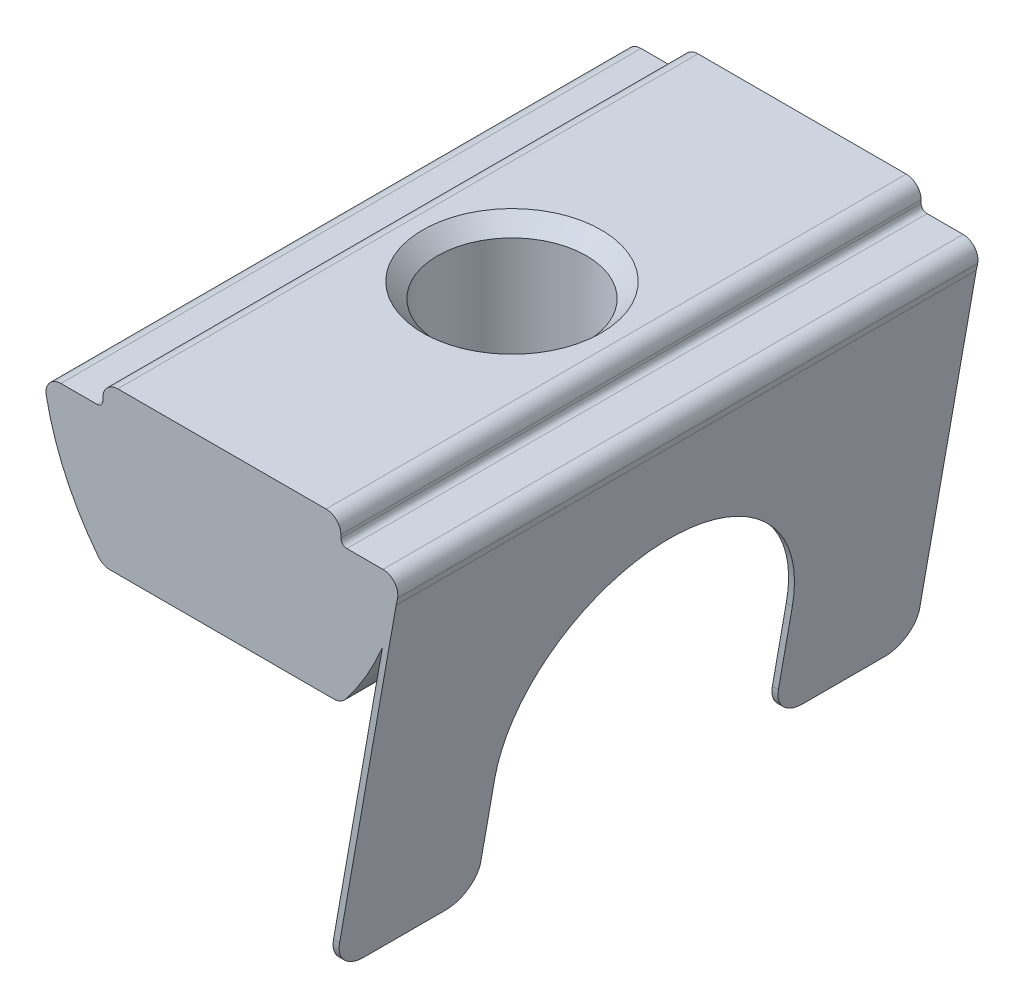
ISO-10303-21;
HEADER;
FILE_DESCRIPTION(('STEP AP214'),'2;1');
FILE_NAME('part.step','',(''),(''),'','','');
FILE_SCHEMA(('AUTOMOTIVE_DESIGN { 1 0 10303 214 1 1 1 1 }'));
ENDSEC;
DATA;
#1=APPLICATION_CONTEXT('core data for automotive mechanical design processes');
#2=APPLICATION_PROTOCOL_DEFINITION('international standard','automotive_design',2000,#1);
#3=PRODUCT_CONTEXT('',#1,'mechanical');
#4=PRODUCT('Part','Part','',(#3));
#5=PRODUCT_RELATED_PRODUCT_CATEGORY('part','',(#4));
#6=PRODUCT_DEFINITION_FORMATION('','',#4);
#7=PRODUCT_DEFINITION_CONTEXT('part definition',#1,'design');
#8=PRODUCT_DEFINITION('design','',#6,#7);
#9=PRODUCT_DEFINITION_SHAPE('','',#8);
#10=(LENGTH_UNIT() NAMED_UNIT(*) SI_UNIT(.MILLI.,.METRE.));
#11=(NAMED_UNIT(*) PLANE_ANGLE_UNIT() SI_UNIT($,.RADIAN.));
#12=(NAMED_UNIT(*) SI_UNIT($,.STERADIAN.) SOLID_ANGLE_UNIT());
#13=UNCERTAINTY_MEASURE_WITH_UNIT(LENGTH_MEASURE(1.E-05),#10,'distance_accuracy_value','');
#14=(GEOMETRIC_REPRESENTATION_CONTEXT(3) GLOBAL_UNCERTAINTY_ASSIGNED_CONTEXT((#13)) GLOBAL_UNIT_ASSIGNED_CONTEXT((#10,
#11,#12)) REPRESENTATION_CONTEXT('',''));
#15=CARTESIAN_POINT('',(0.,0.,0.));
#16=DIRECTION('',(0.,0.,1.));
#17=DIRECTION('',(1.,0.,0.));
#18=AXIS2_PLACEMENT_3D('',#15,#16,#17);
#19=CARTESIAN_POINT('',(2.29567270734946,-3.97311842727961,-23.8344004734254));
#20=DIRECTION('',(0.,-1.,0.));
#21=DIRECTION('',(0.,0.,-1.));
#22=AXIS2_PLACEMENT_3D('',#19,#20,#21);
#23=PLANE('',#22);
#24=DIRECTION('',(0.,0.,1.));
#25=VECTOR('',#24,1.);
#26=CARTESIAN_POINT('',(2.29567270734946,-3.97311842727961,-23.8344004734254));
#27=LINE('',#26,#25);
#28=CARTESIAN_POINT('',(2.29567270734946,-3.97311842727961,4.75242303511413));
#29=VERTEX_POINT('',#28);
#30=CARTESIAN_POINT('',(2.29567270734946,-3.97311842727961,7.50242303511413));
#31=VERTEX_POINT('',#30);
#32=EDGE_CURVE('E247',#29,#31,#27,.T.);
#33=ORIENTED_EDGE('',*,*,#32,.T.);
#34=DIRECTION('',(1.,0.,0.));
#35=VECTOR('',#34,1.);
#36=CARTESIAN_POINT('',(2.09258738497231,-3.97311842727961,7.50242303511413));
#37=LINE('',#36,#35);
#38=CARTESIAN_POINT('',(2.09258738497231,-3.97311842727961,7.50242303511413));
#39=VERTEX_POINT('',#38);
#40=EDGE_CURVE('E402',#31,#39,#37,.F.);
#41=ORIENTED_EDGE('',*,*,#40,.T.);
#42=DIRECTION('',(0.,0.,1.));
#43=VECTOR('',#42,1.);
#44=CARTESIAN_POINT('',(2.09258738497231,-3.97311842727961,-23.8344004734254));
#45=LINE('',#44,#43);
#46=CARTESIAN_POINT('',(2.09258738497231,-3.97311842727961,4.75242303511413));
#47=VERTEX_POINT('',#46);
#48=EDGE_CURVE('E242',#47,#39,#45,.T.);
#49=ORIENTED_EDGE('',*,*,#48,.F.);
#50=DIRECTION('',(-1.,0.,0.));
#51=VECTOR('',#50,1.);
#52=CARTESIAN_POINT('',(2.29567270734946,-3.97311842727961,4.75242303511413));
#53=LINE('',#52,#51);
#54=EDGE_CURVE('E400',#47,#29,#53,.F.);
#55=ORIENTED_EDGE('',*,*,#54,.T.);
#56=EDGE_LOOP('',(#33,#41,#49,#55));
#57=FACE_BOUND('',#56,.T.);
#58=ADVANCED_FACE('F16',(#57),#23,.T.);
#59=CARTESIAN_POINT('',(-4.408320755903,9.77880782753279,8.50242303511413));
#60=DIRECTION('',(0.,0.,-1.));
#61=DIRECTION('',(-1.,0.,0.));
#62=AXIS2_PLACEMENT_3D('',#59,#60,#61);
#63=CYLINDRICAL_SURFACE('',#62,9.);
#64=CARTESIAN_POINT('',(-4.408320755903,9.77880782753279,-10.9975769648859));
#65=DIRECTION('',(0.,0.,1.));
#66=DIRECTION('',(-1.,0.,0.));
#67=AXIS2_PLACEMENT_3D('',#64,#65,#66);
#68=CIRCLE('',#67,9.);
#69=CARTESIAN_POINT('',(4.3721115458505,7.80295140705995,-10.9975769648859));
#70=VERTEX_POINT('',#69);
#71=CARTESIAN_POINT('',(4.4212396874186,8.03557451620278,-10.9975769648859));
#72=VERTEX_POINT('',#71);
#73=EDGE_CURVE('E292',#70,#72,#68,.T.);
#74=ORIENTED_EDGE('',*,*,#73,.T.);
#75=DIRECTION('',(0.,0.,-1.));
#76=VECTOR('',#75,1.);
#77=CARTESIAN_POINT('',(4.4212396874186,8.03557451620278,8.50242303511413));
#78=LINE('',#77,#76);
#79=CARTESIAN_POINT('',(4.4212396874186,8.03557451620278,8.50242303511413));
#80=VERTEX_POINT('',#79);
#81=EDGE_CURVE('E343',#72,#80,#78,.F.);
#82=ORIENTED_EDGE('',*,*,#81,.T.);
#83=CARTESIAN_POINT('',(-4.408320755903,9.77880782753279,8.50242303511413));
#84=DIRECTION('',(0.,0.,1.));
#85=DIRECTION('',(-1.,0.,0.));
#86=AXIS2_PLACEMENT_3D('',#83,#84,#85);
#87=CIRCLE('',#86,9.);
#88=CARTESIAN_POINT('',(4.3721115458505,7.80295140705995,8.50242303511413));
#89=VERTEX_POINT('',#88);
#90=EDGE_CURVE('E270',#89,#80,#87,.T.);
#91=ORIENTED_EDGE('',*,*,#90,.F.);
#92=DIRECTION('',(0.,0.,-1.));
#93=VECTOR('',#92,1.);
#94=CARTESIAN_POINT('',(4.3721115458505,7.80295140705995,8.50242303511413));
#95=LINE('',#94,#93);
#96=EDGE_CURVE('E254',#89,#70,#95,.T.);
#97=ORIENTED_EDGE('',*,*,#96,.T.);
#98=EDGE_LOOP('',(#74,#82,#91,#97));
#99=FACE_BOUND('',#98,.T.);
#100=ADVANCED_FACE('F443',(#99),#63,.T.);
#101=CARTESIAN_POINT('',(-5.48163061851392,8.63242081127667,8.50242303511413));
#102=DIRECTION('',(1.,0.,0.));
#103=DIRECTION('',(0.,0.,-1.));
#104=AXIS2_PLACEMENT_3D('',#101,#102,#103);
#105=PLANE('',#104);
#106=DIRECTION('',(0.,-1.,0.));
#107=VECTOR('',#106,1.);
#108=CARTESIAN_POINT('',(-5.48163061851392,8.63242081127667,-10.9975769648859));
#109=LINE('',#108,#107);
#110=CARTESIAN_POINT('',(-5.48163061851392,8.93242081127667,-10.9975769648859));
#111=VERTEX_POINT('',#110);
#112=CARTESIAN_POINT('',(-5.48163061851392,8.83242081127667,-10.9975769648859));
#113=VERTEX_POINT('',#112);
#114=EDGE_CURVE('E257',#111,#113,#109,.T.);
#115=ORIENTED_EDGE('',*,*,#114,.T.);
#116=DIRECTION('',(0.,0.,-1.));
#117=VECTOR('',#116,1.);
#118=CARTESIAN_POINT('',(-5.48163061851392,8.83242081127667,8.50242303511413));
#119=LINE('',#118,#117);
#120=CARTESIAN_POINT('',(-5.48163061851392,8.83242081127667,8.50242303511413));
#121=VERTEX_POINT('',#120);
#122=EDGE_CURVE('E379',#113,#121,#119,.F.);
#123=ORIENTED_EDGE('',*,*,#122,.T.);
#124=DIRECTION('',(0.,-1.,0.));
#125=VECTOR('',#124,1.);
#126=CARTESIAN_POINT('',(-5.48163061851392,8.63242081127667,8.50242303511413));
#127=LINE('',#126,#125);
#128=CARTESIAN_POINT('',(-5.48163061851392,8.93242081127667,8.50242303511413));
#129=VERTEX_POINT('',#128);
#130=EDGE_CURVE('E258',#129,#121,#127,.T.);
#131=ORIENTED_EDGE('',*,*,#130,.F.);
#132=DIRECTION('',(0.,0.,-1.));
#133=VECTOR('',#132,1.);
#134=CARTESIAN_POINT('',(-5.48163061851392,8.93242081127667,8.50242303511413));
#135=LINE('',#134,#133);
#136=EDGE_CURVE('E356',#129,#111,#135,.T.);
#137=ORIENTED_EDGE('',*,*,#136,.T.);
#138=EDGE_LOOP('',(#115,#123,#131,#137));
#139=FACE_BOUND('',#138,.T.);
#140=ADVANCED_FACE('F449',(#139),#105,.F.);
#141=CARTESIAN_POINT('',(-7.48163061851392,8.63242081127667,8.50242303511413));
#142=DIRECTION('',(0.,-1.,0.));
#143=DIRECTION('',(0.,0.,-1.));
#144=AXIS2_PLACEMENT_3D('',#141,#142,#143);
#145=PLANE('',#144);
#146=DIRECTION('',(-1.,0.,0.));
#147=VECTOR('',#146,1.);
#148=CARTESIAN_POINT('',(-7.48163061851392,8.63242081127667,8.50242303511413));
#149=LINE('',#148,#147);
#150=CARTESIAN_POINT('',(-5.68163061851392,8.63242081127667,8.50242303511413));
#151=VERTEX_POINT('',#150);
#152=CARTESIAN_POINT('',(-6.89396978870635,8.63242081127667,8.50242303511413));
#153=VERTEX_POINT('',#152);
#154=EDGE_CURVE('E261',#151,#153,#149,.T.);
#155=ORIENTED_EDGE('',*,*,#154,.F.);
#156=DIRECTION('',(0.,0.,-1.));
#157=VECTOR('',#156,1.);
#158=CARTESIAN_POINT('',(-5.68163061851392,8.63242081127667,-10.9975769648859));
#159=LINE('',#158,#157);
#160=CARTESIAN_POINT('',(-5.68163061851392,8.63242081127667,-10.9975769648859));
#161=VERTEX_POINT('',#160);
#162=EDGE_CURVE('E376',#151,#161,#159,.T.);
#163=ORIENTED_EDGE('',*,*,#162,.T.);
#164=DIRECTION('',(-1.,0.,0.));
#165=VECTOR('',#164,1.);
#166=CARTESIAN_POINT('',(-7.48163061851392,8.63242081127667,-10.9975769648859));
#167=LINE('',#166,#165);
#168=CARTESIAN_POINT('',(-6.89396978870635,8.63242081127667,-10.9975769648859));
#169=VERTEX_POINT('',#168);
#170=EDGE_CURVE('E284',#161,#169,#167,.T.);
#171=ORIENTED_EDGE('',*,*,#170,.T.);
#172=DIRECTION('',(0.,0.,-1.));
#173=VECTOR('',#172,1.);
#174=CARTESIAN_POINT('',(-6.89396978870635,8.63242081127667,8.50242303511413));
#175=LINE('',#174,#173);
#176=EDGE_CURVE('E345',#169,#153,#175,.F.);
#177=ORIENTED_EDGE('',*,*,#176,.T.);
#178=EDGE_LOOP('',(#155,#163,#171,#177));
#179=FACE_BOUND('',#178,.T.);
#180=ADVANCED_FACE('F499',(#179),#145,.F.);
#181=CARTESIAN_POINT('',(1.44505951887515,9.77880782753279,8.50242303511413));
#182=DIRECTION('',(0.,0.,-1.));
#183=DIRECTION('',(-1.,0.,0.));
#184=AXIS2_PLACEMENT_3D('',#181,#182,#183);
#185=CYLINDRICAL_SURFACE('',#184,9.);
#186=CARTESIAN_POINT('',(1.44505951887515,9.77880782753279,-10.9975769648859));
#187=DIRECTION('',(0.,0.,1.));
#188=DIRECTION('',(1.,0.,0.));
#189=AXIS2_PLACEMENT_3D('',#186,#187,#188);
#190=CIRCLE('',#189,9.);
#191=CARTESIAN_POINT('',(-7.38450092444644,8.03557451620278,-10.9975769648859));
#192=VERTEX_POINT('',#191);
#193=CARTESIAN_POINT('',(-5.6360418805377,4.22380981032043,-10.9975769648859));
#194=VERTEX_POINT('',#193);
#195=EDGE_CURVE('E286',#192,#194,#190,.T.);
#196=ORIENTED_EDGE('',*,*,#195,.T.);
#197=DIRECTION('',(0.,0.,-1.));
#198=VECTOR('',#197,1.);
#199=CARTESIAN_POINT('',(-5.6360418805377,4.22380981032043,8.50242303511413));
#200=LINE('',#199,#198);
#201=CARTESIAN_POINT('',(-5.6360418805377,4.22380981032043,8.50242303511413));
#202=VERTEX_POINT('',#201);
#203=EDGE_CURVE('E338',#194,#202,#200,.F.);
#204=ORIENTED_EDGE('',*,*,#203,.T.);
#205=CARTESIAN_POINT('',(1.44505951887515,9.77880782753279,8.50242303511413));
#206=DIRECTION('',(0.,0.,1.));
#207=DIRECTION('',(1.,0.,0.));
#208=AXIS2_PLACEMENT_3D('',#205,#206,#207);
#209=CIRCLE('',#208,9.);
#210=CARTESIAN_POINT('',(-7.38450092444644,8.03557451620278,8.50242303511413));
#211=VERTEX_POINT('',#210);
#212=EDGE_CURVE('E264',#211,#202,#209,.T.);
#213=ORIENTED_EDGE('',*,*,#212,.F.);
#214=DIRECTION('',(0.,0.,-1.));
#215=VECTOR('',#214,1.);
#216=CARTESIAN_POINT('',(-7.38450092444644,8.03557451620278,8.50242303511413));
#217=LINE('',#216,#215);
#218=EDGE_CURVE('E335',#211,#192,#217,.T.);
#219=ORIENTED_EDGE('',*,*,#218,.T.);
#220=EDGE_LOOP('',(#196,#204,#213,#219));
#221=FACE_BOUND('',#220,.T.);
#222=ADVANCED_FACE('F495',(#221),#185,.T.);
#223=CARTESIAN_POINT('',(2.51836938148608,4.03242081127667,8.50242303511413));
#224=DIRECTION('',(0.,1.,0.));
#225=DIRECTION('',(0.,0.,1.));
#226=AXIS2_PLACEMENT_3D('',#223,#224,#225);
#227=PLANE('',#226);
#228=CARTESIAN_POINT('',(-1.48163061851392,4.03242081127667,-1.24757696488587));
#229=DIRECTION('',(0.,1.,0.));
#230=DIRECTION('',(0.,0.,1.));
#231=AXIS2_PLACEMENT_3D('',#228,#229,#230);
#232=CIRCLE('',#231,3.);
#233=CARTESIAN_POINT('',(-1.48163061851392,4.03242081127667,1.75242303511413));
#234=VERTEX_POINT('',#233);
#235=EDGE_CURVE('E359',#234,#234,#232,.T.);
#236=ORIENTED_EDGE('',*,*,#235,.T.);
#237=EDGE_LOOP('',(#236));
#238=FACE_BOUND('',#237,.T.);
#239=DIRECTION('',(1.,0.,0.));
#240=VECTOR('',#239,1.);
#241=CARTESIAN_POINT('',(2.51836938148608,4.03242081127667,-10.9975769648859));
#242=LINE('',#241,#240);
#243=CARTESIAN_POINT('',(-5.2426473583481,4.03242081127667,-10.9975769648859));
#244=VERTEX_POINT('',#243);
#245=CARTESIAN_POINT('',(2.27938612132026,4.03242081127667,-10.9975769648859));
#246=VERTEX_POINT('',#245);
#247=EDGE_CURVE('E289',#244,#246,#242,.T.);
#248=ORIENTED_EDGE('',*,*,#247,.T.);
#249=DIRECTION('',(0.,0.,-1.));
#250=VECTOR('',#249,1.);
#251=CARTESIAN_POINT('',(2.27938612132026,4.03242081127667,8.50242303511413));
#252=LINE('',#251,#250);
#253=CARTESIAN_POINT('',(2.27938612132026,4.03242081127667,8.50242303511413));
#254=VERTEX_POINT('',#253);
#255=EDGE_CURVE('E321',#246,#254,#252,.F.);
#256=ORIENTED_EDGE('',*,*,#255,.T.);
#257=DIRECTION('',(1.,0.,0.));
#258=VECTOR('',#257,1.);
#259=CARTESIAN_POINT('',(2.51836938148608,4.03242081127667,8.50242303511413));
#260=LINE('',#259,#258);
#261=CARTESIAN_POINT('',(-5.2426473583481,4.03242081127667,8.50242303511413));
#262=VERTEX_POINT('',#261);
#263=EDGE_CURVE('E267',#262,#254,#260,.T.);
#264=ORIENTED_EDGE('',*,*,#263,.F.);
#265=DIRECTION('',(0.,0.,-1.));
#266=VECTOR('',#265,1.);
#267=CARTESIAN_POINT('',(-5.2426473583481,4.03242081127667,8.50242303511413));
#268=LINE('',#267,#266);
#269=EDGE_CURVE('E318',#262,#244,#268,.T.);
#270=ORIENTED_EDGE('',*,*,#269,.T.);
#271=EDGE_LOOP('',(#248,#256,#264,#270));
#272=FACE_BOUND('',#271,.T.);
#273=ADVANCED_FACE('F491',(#238,#272),#227,.F.);
#274=CARTESIAN_POINT('',(2.67278064350986,4.22380981032043,8.50242303511413));
#275=VERTEX_POINT('',#274);
#276=CARTESIAN_POINT('',(3.91275534065847,6.34956700845439,8.50242303511413));
#277=VERTEX_POINT('',#276);
#278=EDGE_CURVE('E271',#275,#277,#87,.T.);
#279=ORIENTED_EDGE('',*,*,#278,.F.);
#280=DIRECTION('',(0.,0.,-1.));
#281=VECTOR('',#280,1.);
#282=CARTESIAN_POINT('',(2.67278064350986,4.22380981032043,8.50242303511413));
#283=LINE('',#282,#281);
#284=CARTESIAN_POINT('',(2.67278064350986,4.22380981032043,-10.9975769648859));
#285=VERTEX_POINT('',#284);
#286=EDGE_CURVE('E281',#275,#285,#283,.T.);
#287=ORIENTED_EDGE('',*,*,#286,.T.);
#288=CARTESIAN_POINT('',(3.91275534065846,6.34956700845438,-10.9975769648859));
#289=VERTEX_POINT('',#288);
#290=EDGE_CURVE('E293',#285,#289,#68,.T.);
#291=ORIENTED_EDGE('',*,*,#290,.T.);
#292=DIRECTION('',(0.,0.,1.));
#293=VECTOR('',#292,1.);
#294=CARTESIAN_POINT('',(3.91275534065846,6.34956700845438,-23.8344004734254));
#295=LINE('',#294,#293);
#296=EDGE_CURVE('E245',#289,#277,#295,.T.);
#297=ORIENTED_EDGE('',*,*,#296,.T.);
#298=EDGE_LOOP('',(#279,#287,#291,#297));
#299=FACE_BOUND('',#298,.T.);
#300=ADVANCED_FACE('F452',(#299),#63,.T.);
#301=CARTESIAN_POINT('',(2.51836938148608,8.63242081127667,8.50242303511413));
#302=DIRECTION('',(0.,-1.,0.));
#303=DIRECTION('',(0.,0.,-1.));
#304=AXIS2_PLACEMENT_3D('',#301,#302,#303);
#305=PLANE('',#304);
#306=DIRECTION('',(-1.,0.,0.));
#307=VECTOR('',#306,1.);
#308=CARTESIAN_POINT('',(2.51836938148608,8.63242081127667,-10.9975769648859));
#309=LINE('',#308,#307);
#310=CARTESIAN_POINT('',(3.93070855167851,8.63242081127667,-10.9975769648859));
#311=VERTEX_POINT('',#310);
#312=CARTESIAN_POINT('',(2.71836938148608,8.63242081127667,-10.9975769648859));
#313=VERTEX_POINT('',#312);
#314=EDGE_CURVE('E295',#311,#313,#309,.T.);
#315=ORIENTED_EDGE('',*,*,#314,.T.);
#316=DIRECTION('',(0.,0.,-1.));
#317=VECTOR('',#316,1.);
#318=CARTESIAN_POINT('',(2.71836938148608,8.63242081127667,8.50242303511413));
#319=LINE('',#318,#317);
#320=CARTESIAN_POINT('',(2.71836938148608,8.63242081127667,8.50242303511413));
#321=VERTEX_POINT('',#320);
#322=EDGE_CURVE('E374',#313,#321,#319,.F.);
#323=ORIENTED_EDGE('',*,*,#322,.T.);
#324=DIRECTION('',(-1.,0.,0.));
#325=VECTOR('',#324,1.);
#326=CARTESIAN_POINT('',(2.51836938148608,8.63242081127667,8.50242303511413));
#327=LINE('',#326,#325);
#328=CARTESIAN_POINT('',(3.93070855167851,8.63242081127667,8.50242303511413));
#329=VERTEX_POINT('',#328);
#330=EDGE_CURVE('E273',#329,#321,#327,.T.);
#331=ORIENTED_EDGE('',*,*,#330,.F.);
#332=DIRECTION('',(0.,0.,-1.));
#333=VECTOR('',#332,1.);
#334=CARTESIAN_POINT('',(3.93070855167851,8.63242081127667,8.50242303511413));
#335=LINE('',#334,#333);
#336=EDGE_CURVE('E340',#329,#311,#335,.T.);
#337=ORIENTED_EDGE('',*,*,#336,.T.);
#338=EDGE_LOOP('',(#315,#323,#331,#337));
#339=FACE_BOUND('',#338,.T.);
#340=ADVANCED_FACE('F485',(#339),#305,.F.);
#341=CARTESIAN_POINT('',(2.51836938148608,9.43242081127667,8.50242303511413));
#342=DIRECTION('',(-1.,0.,0.));
#343=DIRECTION('',(0.,0.,1.));
#344=AXIS2_PLACEMENT_3D('',#341,#342,#343);
#345=PLANE('',#344);
#346=DIRECTION('',(0.,1.,0.));
#347=VECTOR('',#346,1.);
#348=CARTESIAN_POINT('',(2.51836938148608,9.43242081127667,8.50242303511413));
#349=LINE('',#348,#347);
#350=CARTESIAN_POINT('',(2.51836938148608,8.83242081127667,8.50242303511413));
#351=VERTEX_POINT('',#350);
#352=CARTESIAN_POINT('',(2.51836938148608,8.93242081127667,8.50242303511413));
#353=VERTEX_POINT('',#352);
#354=EDGE_CURVE('E276',#351,#353,#349,.T.);
#355=ORIENTED_EDGE('',*,*,#354,.F.);
#356=DIRECTION('',(0.,0.,-1.));
#357=VECTOR('',#356,1.);
#358=CARTESIAN_POINT('',(2.51836938148608,8.83242081127667,-10.9975769648859));
#359=LINE('',#358,#357);
#360=CARTESIAN_POINT('',(2.51836938148608,8.83242081127667,-10.9975769648859));
#361=VERTEX_POINT('',#360);
#362=EDGE_CURVE('E371',#351,#361,#359,.T.);
#363=ORIENTED_EDGE('',*,*,#362,.T.);
#364=DIRECTION('',(0.,1.,0.));
#365=VECTOR('',#364,1.);
#366=CARTESIAN_POINT('',(2.51836938148608,9.43242081127667,-10.9975769648859));
#367=LINE('',#366,#365);
#368=CARTESIAN_POINT('',(2.51836938148608,8.93242081127667,-10.9975769648859));
#369=VERTEX_POINT('',#368);
#370=EDGE_CURVE('E298',#361,#369,#367,.T.);
#371=ORIENTED_EDGE('',*,*,#370,.T.);
#372=DIRECTION('',(0.,0.,-1.));
#373=VECTOR('',#372,1.);
#374=CARTESIAN_POINT('',(2.51836938148608,8.93242081127667,8.50242303511413));
#375=LINE('',#374,#373);
#376=EDGE_CURVE('E353',#369,#353,#375,.F.);
#377=ORIENTED_EDGE('',*,*,#376,.T.);
#378=EDGE_LOOP('',(#355,#363,#371,#377));
#379=FACE_BOUND('',#378,.T.);
#380=ADVANCED_FACE('F481',(#379),#345,.F.);
#381=CARTESIAN_POINT('',(-5.48163061851392,9.43242081127667,8.50242303511413));
#382=DIRECTION('',(0.,-1.,0.));
#383=DIRECTION('',(1.,0.,0.));
#384=AXIS2_PLACEMENT_3D('',#381,#382,#383);
#385=PLANE('',#384);
#386=CARTESIAN_POINT('',(-1.48163061851392,9.43242081127667,-1.24757696488587));
#387=DIRECTION('',(0.,-1.,0.));
#388=DIRECTION('',(1.,0.,0.));
#389=AXIS2_PLACEMENT_3D('',#386,#387,#388);
#390=CIRCLE('',#389,3.);
#391=CARTESIAN_POINT('',(1.51836938148608,9.43242081127667,-1.24757696488587));
#392=VERTEX_POINT('',#391);
#393=EDGE_CURVE('E368',#392,#392,#390,.T.);
#394=ORIENTED_EDGE('',*,*,#393,.T.);
#395=EDGE_LOOP('',(#394));
#396=FACE_BOUND('',#395,.T.);
#397=DIRECTION('',(-1.,0.,0.));
#398=VECTOR('',#397,1.);
#399=CARTESIAN_POINT('',(-5.48163061851392,9.43242081127667,8.50242303511413));
#400=LINE('',#399,#398);
#401=CARTESIAN_POINT('',(2.01836938148608,9.43242081127667,8.50242303511413));
#402=VERTEX_POINT('',#401);
#403=CARTESIAN_POINT('',(-4.98163061851392,9.43242081127667,8.50242303511413));
#404=VERTEX_POINT('',#403);
#405=EDGE_CURVE('E278',#402,#404,#400,.T.);
#406=ORIENTED_EDGE('',*,*,#405,.F.);
#407=DIRECTION('',(0.,0.,-1.));
#408=VECTOR('',#407,1.);
#409=CARTESIAN_POINT('',(2.01836938148608,9.43242081127667,8.50242303511413));
#410=LINE('',#409,#408);
#411=CARTESIAN_POINT('',(2.01836938148608,9.43242081127667,-10.9975769648859));
#412=VERTEX_POINT('',#411);
#413=EDGE_CURVE('E350',#402,#412,#410,.T.);
#414=ORIENTED_EDGE('',*,*,#413,.T.);
#415=DIRECTION('',(-1.,0.,0.));
#416=VECTOR('',#415,1.);
#417=CARTESIAN_POINT('',(-5.48163061851392,9.43242081127667,-10.9975769648859));
#418=LINE('',#417,#416);
#419=CARTESIAN_POINT('',(-4.98163061851392,9.43242081127667,-10.9975769648859));
#420=VERTEX_POINT('',#419);
#421=EDGE_CURVE('E262',#412,#420,#418,.T.);
#422=ORIENTED_EDGE('',*,*,#421,.T.);
#423=DIRECTION('',(0.,0.,-1.));
#424=VECTOR('',#423,1.);
#425=CARTESIAN_POINT('',(-4.98163061851392,9.43242081127667,8.50242303511413));
#426=LINE('',#425,#424);
#427=EDGE_CURVE('E348',#420,#404,#426,.F.);
#428=ORIENTED_EDGE('',*,*,#427,.T.);
#429=EDGE_LOOP('',(#406,#414,#422,#428));
#430=FACE_BOUND('',#429,.T.);
#431=ADVANCED_FACE('F475',(#396,#430),#385,.F.);
#432=CARTESIAN_POINT('',(-4.408320755903,9.77880782753279,8.50242303511413));
#433=DIRECTION('',(0.,0.,-1.));
#434=DIRECTION('',(-1.,0.,0.));
#435=AXIS2_PLACEMENT_3D('',#432,#433,#434);
#436=PLANE('',#435);
#437=DIRECTION('',(-0.173648177666923,-0.984807753012209,0.));
#438=VECTOR('',#437,1.);
#439=CARTESIAN_POINT('',(2.40231475525826,-2.21656722313887,8.50242303511413));
#440=LINE('',#439,#438);
#441=CARTESIAN_POINT('',(2.26891436568077,-2.97311842727961,8.50242303511413));
#442=VERTEX_POINT('',#441);
#443=EDGE_CURVE('E233',#277,#442,#440,.T.);
#444=ORIENTED_EDGE('',*,*,#443,.T.);
#445=DIRECTION('',(1.,0.,0.));
#446=VECTOR('',#445,1.);
#447=CARTESIAN_POINT('',(2.29567270734946,-2.97311842727961,8.50242303511413));
#448=LINE('',#447,#446);
#449=CARTESIAN_POINT('',(2.47199968805792,-2.97311842727961,8.50242303511413));
#450=VERTEX_POINT('',#449);
#451=EDGE_CURVE('E389',#442,#450,#448,.T.);
#452=ORIENTED_EDGE('',*,*,#451,.T.);
#453=DIRECTION('',(0.173648177666923,0.984807753012209,0.));
#454=VECTOR('',#453,1.);
#455=CARTESIAN_POINT('',(4.51836938148608,8.63242081127667,8.50242303511413));
#456=LINE('',#455,#454);
#457=EDGE_CURVE('E235',#450,#89,#456,.T.);
#458=ORIENTED_EDGE('',*,*,#457,.T.);
#459=ORIENTED_EDGE('',*,*,#90,.T.);
#460=CARTESIAN_POINT('',(3.93070855167851,8.13242081127667,8.50242303511413));
#461=DIRECTION('',(0.,0.,-1.));
#462=DIRECTION('',(-1.,0.,0.));
#463=AXIS2_PLACEMENT_3D('',#460,#461,#462);
#464=CIRCLE('',#463,0.5);
#465=EDGE_CURVE('E329',#80,#329,#464,.F.);
#466=ORIENTED_EDGE('',*,*,#465,.T.);
#467=ORIENTED_EDGE('',*,*,#330,.T.);
#468=CARTESIAN_POINT('',(2.71836938148608,8.83242081127667,8.50242303511413));
#469=DIRECTION('',(0.,0.,-1.));
#470=DIRECTION('',(-1.,0.,0.));
#471=AXIS2_PLACEMENT_3D('',#468,#469,#470);
#472=CIRCLE('',#471,0.2);
#473=EDGE_CURVE('E383',#321,#351,#472,.T.);
#474=ORIENTED_EDGE('',*,*,#473,.T.);
#475=ORIENTED_EDGE('',*,*,#354,.T.);
#476=CARTESIAN_POINT('',(2.01836938148608,8.93242081127667,8.50242303511413));
#477=DIRECTION('',(0.,0.,-1.));
#478=DIRECTION('',(-1.,0.,0.));
#479=AXIS2_PLACEMENT_3D('',#476,#477,#478);
#480=CIRCLE('',#479,0.5);
#481=EDGE_CURVE('E325',#353,#402,#480,.F.);
#482=ORIENTED_EDGE('',*,*,#481,.T.);
#483=ORIENTED_EDGE('',*,*,#405,.T.);
#484=CARTESIAN_POINT('',(-4.98163061851392,8.93242081127667,8.50242303511413));
#485=DIRECTION('',(0.,0.,-1.));
#486=DIRECTION('',(-1.,0.,0.));
#487=AXIS2_PLACEMENT_3D('',#484,#485,#486);
#488=CIRCLE('',#487,0.5);
#489=EDGE_CURVE('E323',#404,#129,#488,.F.);
#490=ORIENTED_EDGE('',*,*,#489,.T.);
#491=ORIENTED_EDGE('',*,*,#130,.T.);
#492=CARTESIAN_POINT('',(-5.68163061851392,8.83242081127667,8.50242303511413));
#493=DIRECTION('',(0.,0.,-1.));
#494=DIRECTION('',(-1.,0.,0.));
#495=AXIS2_PLACEMENT_3D('',#492,#493,#494);
#496=CIRCLE('',#495,0.2);
#497=EDGE_CURVE('E387',#121,#151,#496,.T.);
#498=ORIENTED_EDGE('',*,*,#497,.T.);
#499=ORIENTED_EDGE('',*,*,#154,.T.);
#500=CARTESIAN_POINT('',(-6.89396978870635,8.13242081127667,8.50242303511413));
#501=DIRECTION('',(0.,0.,-1.));
#502=DIRECTION('',(-1.,0.,0.));
#503=AXIS2_PLACEMENT_3D('',#500,#501,#502);
#504=CIRCLE('',#503,0.5);
#505=EDGE_CURVE('E327',#153,#211,#504,.F.);
#506=ORIENTED_EDGE('',*,*,#505,.T.);
#507=ORIENTED_EDGE('',*,*,#212,.T.);
#508=CARTESIAN_POINT('',(-5.2426473583481,4.53242081127667,8.50242303511413));
#509=DIRECTION('',(0.,0.,-1.));
#510=DIRECTION('',(-1.,0.,0.));
#511=AXIS2_PLACEMENT_3D('',#508,#509,#510);
#512=CIRCLE('',#511,0.5);
#513=EDGE_CURVE('E331',#202,#262,#512,.F.);
#514=ORIENTED_EDGE('',*,*,#513,.T.);
#515=ORIENTED_EDGE('',*,*,#263,.T.);
#516=CARTESIAN_POINT('',(2.27938612132026,4.53242081127667,8.50242303511413));
#517=DIRECTION('',(0.,0.,-1.));
#518=DIRECTION('',(-1.,0.,0.));
#519=AXIS2_PLACEMENT_3D('',#516,#517,#518);
#520=CIRCLE('',#519,0.5);
#521=EDGE_CURVE('E333',#254,#275,#520,.F.);
#522=ORIENTED_EDGE('',*,*,#521,.T.);
#523=ORIENTED_EDGE('',*,*,#278,.T.);
#524=EDGE_LOOP('',(#444,#452,#458,#459,#466,#467,#474,#475,#482,#483,#490,#491,#498,#499,#506,
#507,#514,#515,#522,#523));
#525=FACE_BOUND('',#524,.T.);
#526=ADVANCED_FACE('F472',(#525),#436,.F.);
#527=CARTESIAN_POINT('',(-4.408320755903,9.77880782753279,-10.9975769648859));
#528=DIRECTION('',(0.,0.,-1.));
#529=DIRECTION('',(-1.,0.,0.));
#530=AXIS2_PLACEMENT_3D('',#527,#528,#529);
#531=PLANE('',#530);
#532=DIRECTION('',(0.173648177666923,0.984807753012209,0.));
#533=VECTOR('',#532,1.);
#534=CARTESIAN_POINT('',(4.51836938148608,8.63242081127667,-10.9975769648859));
#535=LINE('',#534,#533);
#536=CARTESIAN_POINT('',(2.47199968805792,-2.97311842727961,-10.9975769648859));
#537=VERTEX_POINT('',#536);
#538=EDGE_CURVE('E243',#537,#70,#535,.T.);
#539=ORIENTED_EDGE('',*,*,#538,.F.);
#540=DIRECTION('',(1.,0.,0.));
#541=VECTOR('',#540,1.);
#542=CARTESIAN_POINT('',(-4.408320755903,-2.97311842727961,-10.9975769648859));
#543=LINE('',#542,#541);
#544=CARTESIAN_POINT('',(2.26891436568077,-2.97311842727961,-10.9975769648859));
#545=VERTEX_POINT('',#544);
#546=EDGE_CURVE('E24',#537,#545,#543,.F.);
#547=ORIENTED_EDGE('',*,*,#546,.T.);
#548=DIRECTION('',(-0.173648177666923,-0.984807753012209,0.));
#549=VECTOR('',#548,1.);
#550=CARTESIAN_POINT('',(2.40231475525826,-2.21656722313887,-10.9975769648859));
#551=LINE('',#550,#549);
#552=EDGE_CURVE('E237',#289,#545,#551,.T.);
#553=ORIENTED_EDGE('',*,*,#552,.F.);
#554=ORIENTED_EDGE('',*,*,#290,.F.);
#555=CARTESIAN_POINT('',(2.27938612132026,4.53242081127667,-10.9975769648859));
#556=DIRECTION('',(0.,0.,-1.));
#557=DIRECTION('',(-1.,0.,0.));
#558=AXIS2_PLACEMENT_3D('',#555,#556,#557);
#559=CIRCLE('',#558,0.5);
#560=EDGE_CURVE('E316',#285,#246,#559,.T.);
#561=ORIENTED_EDGE('',*,*,#560,.T.);
#562=ORIENTED_EDGE('',*,*,#247,.F.);
#563=CARTESIAN_POINT('',(-5.2426473583481,4.53242081127667,-10.9975769648859));
#564=DIRECTION('',(0.,0.,-1.));
#565=DIRECTION('',(-1.,0.,0.));
#566=AXIS2_PLACEMENT_3D('',#563,#564,#565);
#567=CIRCLE('',#566,0.5);
#568=EDGE_CURVE('E314',#244,#194,#567,.T.);
#569=ORIENTED_EDGE('',*,*,#568,.T.);
#570=ORIENTED_EDGE('',*,*,#195,.F.);
#571=CARTESIAN_POINT('',(-6.89396978870635,8.13242081127667,-10.9975769648859));
#572=DIRECTION('',(0.,0.,-1.));
#573=DIRECTION('',(-1.,0.,0.));
#574=AXIS2_PLACEMENT_3D('',#571,#572,#573);
#575=CIRCLE('',#574,0.5);
#576=EDGE_CURVE('E309',#192,#169,#575,.T.);
#577=ORIENTED_EDGE('',*,*,#576,.T.);
#578=ORIENTED_EDGE('',*,*,#170,.F.);
#579=CARTESIAN_POINT('',(-5.68163061851392,8.83242081127667,-10.9975769648859));
#580=DIRECTION('',(0.,0.,-1.));
#581=DIRECTION('',(-1.,0.,0.));
#582=AXIS2_PLACEMENT_3D('',#579,#580,#581);
#583=CIRCLE('',#582,0.2);
#584=EDGE_CURVE('E385',#161,#113,#583,.F.);
#585=ORIENTED_EDGE('',*,*,#584,.T.);
#586=ORIENTED_EDGE('',*,*,#114,.F.);
#587=CARTESIAN_POINT('',(-4.98163061851392,8.93242081127667,-10.9975769648859));
#588=DIRECTION('',(0.,0.,-1.));
#589=DIRECTION('',(-1.,0.,0.));
#590=AXIS2_PLACEMENT_3D('',#587,#588,#589);
#591=CIRCLE('',#590,0.5);
#592=EDGE_CURVE('E304',#111,#420,#591,.T.);
#593=ORIENTED_EDGE('',*,*,#592,.T.);
#594=ORIENTED_EDGE('',*,*,#421,.F.);
#595=CARTESIAN_POINT('',(2.01836938148608,8.93242081127667,-10.9975769648859));
#596=DIRECTION('',(0.,0.,-1.));
#597=DIRECTION('',(-1.,0.,0.));
#598=AXIS2_PLACEMENT_3D('',#595,#596,#597);
#599=CIRCLE('',#598,0.5);
#600=EDGE_CURVE('E306',#412,#369,#599,.T.);
#601=ORIENTED_EDGE('',*,*,#600,.T.);
#602=ORIENTED_EDGE('',*,*,#370,.F.);
#603=CARTESIAN_POINT('',(2.71836938148608,8.83242081127667,-10.9975769648859));
#604=DIRECTION('',(0.,0.,-1.));
#605=DIRECTION('',(-1.,0.,0.));
#606=AXIS2_PLACEMENT_3D('',#603,#604,#605);
#607=CIRCLE('',#606,0.2);
#608=EDGE_CURVE('E381',#361,#313,#607,.F.);
#609=ORIENTED_EDGE('',*,*,#608,.T.);
#610=ORIENTED_EDGE('',*,*,#314,.F.);
#611=CARTESIAN_POINT('',(3.93070855167851,8.13242081127667,-10.9975769648859));
#612=DIRECTION('',(0.,0.,-1.));
#613=DIRECTION('',(-1.,0.,0.));
#614=AXIS2_PLACEMENT_3D('',#611,#612,#613);
#615=CIRCLE('',#614,0.5);
#616=EDGE_CURVE('E312',#311,#72,#615,.T.);
#617=ORIENTED_EDGE('',*,*,#616,.T.);
#618=ORIENTED_EDGE('',*,*,#73,.F.);
#619=EDGE_LOOP('',(#539,#547,#553,#554,#561,#562,#569,#570,#577,#578,#585,#586,#593,#594,#601,
#602,#609,#610,#617,#618));
#620=FACE_BOUND('',#619,.T.);
#621=ADVANCED_FACE('F421',(#620),#531,.T.);
#622=CARTESIAN_POINT('',(-1.48163061851392,4.03242081127667,-1.24757696488587));
#623=DIRECTION('',(0.,1.,0.));
#624=DIRECTION('',(-1.,0.,0.));
#625=AXIS2_PLACEMENT_3D('',#622,#623,#624);
#626=CYLINDRICAL_SURFACE('',#625,2.5);
#627=CARTESIAN_POINT('',(-1.48163061851392,4.53242081127667,-1.24757696488587));
#628=DIRECTION('',(0.,1.,0.));
#629=DIRECTION('',(-1.,0.,0.));
#630=AXIS2_PLACEMENT_3D('',#627,#628,#629);
#631=CIRCLE('',#630,2.5);
#632=CARTESIAN_POINT('',(-3.98163061851392,4.53242081127667,-1.24757696488587));
#633=VERTEX_POINT('',#632);
#634=EDGE_CURVE('E365',#633,#633,#631,.F.);
#635=ORIENTED_EDGE('',*,*,#634,.T.);
#636=EDGE_LOOP('',(#635));
#637=FACE_BOUND('',#636,.T.);
#638=CARTESIAN_POINT('',(-1.48163061851392,8.93242081127667,-1.24757696488587));
#639=DIRECTION('',(0.,-1.,0.));
#640=DIRECTION('',(1.,0.,0.));
#641=AXIS2_PLACEMENT_3D('',#638,#639,#640);
#642=CIRCLE('',#641,2.5);
#643=CARTESIAN_POINT('',(1.01836938148608,8.93242081127667,-1.24757696488587));
#644=VERTEX_POINT('',#643);
#645=EDGE_CURVE('E362',#644,#644,#642,.F.);
#646=ORIENTED_EDGE('',*,*,#645,.T.);
#647=EDGE_LOOP('',(#646));
#648=FACE_BOUND('',#647,.T.);
#649=ADVANCED_FACE('F467',(#637,#648),#626,.F.);
#650=CARTESIAN_POINT('',(4.51836938148608,8.63242081127667,-23.8344004734254));
#651=DIRECTION('',(0.984807753012209,-0.173648177666923,0.));
#652=DIRECTION('',(0.173648177666923,0.984807753012209,0.));
#653=AXIS2_PLACEMENT_3D('',#650,#651,#652);
#654=PLANE('',#653);
#655=ORIENTED_EDGE('',*,*,#457,.F.);
#656=CARTESIAN_POINT('',(2.47199968805792,-2.97311842727961,7.50242303511413));
#657=DIRECTION('',(0.984807753012209,-0.173648177666923,0.));
#658=DIRECTION('',(-0.173648177666923,-0.984807753012209,0.));
#659=AXIS2_PLACEMENT_3D('',#656,#657,#658);
#660=ELLIPSE('',#659,1.01542661188574,1.);
#661=EDGE_CURVE('E398',#450,#31,#660,.T.);
#662=ORIENTED_EDGE('',*,*,#661,.T.);
#663=ORIENTED_EDGE('',*,*,#32,.F.);
#664=CARTESIAN_POINT('',(2.47199968805792,-2.97311842727961,4.75242303511413));
#665=DIRECTION('',(0.984807753012209,-0.173648177666923,0.));
#666=DIRECTION('',(0.173648177666923,0.984807753012209,0.));
#667=AXIS2_PLACEMENT_3D('',#664,#665,#666);
#668=ELLIPSE('',#667,1.01542661188574,1.);
#669=CARTESIAN_POINT('',(2.47199968805792,-2.97311842727961,3.75242303511413));
#670=VERTEX_POINT('',#669);
#671=EDGE_CURVE('E396',#29,#670,#668,.T.);
#672=ORIENTED_EDGE('',*,*,#671,.T.);
#673=DIRECTION('',(-0.173648177666923,-0.984807753012209,0.));
#674=VECTOR('',#673,1.);
#675=CARTESIAN_POINT('',(2.06957475189292,-5.25538365151309,3.75242303511413));
#676=LINE('',#675,#674);
#677=CARTESIAN_POINT('',(2.93781564022754,-0.331344886452044,3.75242303511413));
#678=VERTEX_POINT('',#677);
#679=EDGE_CURVE('E210',#678,#670,#676,.T.);
#680=ORIENTED_EDGE('',*,*,#679,.F.);
#681=CARTESIAN_POINT('',(2.93781564022754,-0.331344886452044,-1.24757696488587));
#682=DIRECTION('',(0.984807753012209,-0.173648177666923,0.));
#683=DIRECTION('',(0.173648177666923,0.984807753012209,0.));
#684=AXIS2_PLACEMENT_3D('',#681,#682,#683);
#685=CIRCLE('',#684,5.);
#686=CARTESIAN_POINT('',(2.93781564022754,-0.331344886452045,-6.24757696488587));
#687=VERTEX_POINT('',#686);
#688=EDGE_CURVE('E229',#687,#678,#685,.T.);
#689=ORIENTED_EDGE('',*,*,#688,.F.);
#690=DIRECTION('',(0.173648177666923,0.984807753012209,0.));
#691=VECTOR('',#690,1.);
#692=CARTESIAN_POINT('',(2.06957475189292,-5.25538365151309,-6.24757696488587));
#693=LINE('',#692,#691);
#694=CARTESIAN_POINT('',(2.47199968805792,-2.97311842727961,-6.24757696488587));
#695=VERTEX_POINT('',#694);
#696=EDGE_CURVE('E216',#695,#687,#693,.T.);
#697=ORIENTED_EDGE('',*,*,#696,.F.);
#698=CARTESIAN_POINT('',(2.47199968805792,-2.97311842727961,-7.24757696488587));
#699=DIRECTION('',(0.984807753012209,-0.173648177666923,0.));
#700=DIRECTION('',(-0.173648177666923,-0.984807753012209,0.));
#701=AXIS2_PLACEMENT_3D('',#698,#699,#700);
#702=ELLIPSE('',#701,1.01542661188574,1.);
#703=CARTESIAN_POINT('',(2.29567270734946,-3.97311842727961,-7.24757696488586));
#704=VERTEX_POINT('',#703);
#705=EDGE_CURVE('E392',#695,#704,#702,.T.);
#706=ORIENTED_EDGE('',*,*,#705,.T.);
#707=CARTESIAN_POINT('',(2.29567270734946,-3.97311842727961,-9.99757696488587));
#708=VERTEX_POINT('',#707);
#709=EDGE_CURVE('E246',#708,#704,#27,.T.);
#710=ORIENTED_EDGE('',*,*,#709,.F.);
#711=CARTESIAN_POINT('',(2.47199968805792,-2.97311842727961,-9.99757696488587));
#712=DIRECTION('',(0.984807753012209,-0.173648177666923,0.));
#713=DIRECTION('',(0.173648177666923,0.984807753012209,0.));
#714=AXIS2_PLACEMENT_3D('',#711,#712,#713);
#715=ELLIPSE('',#714,1.01542661188574,1.);
#716=EDGE_CURVE('E394',#708,#537,#715,.T.);
#717=ORIENTED_EDGE('',*,*,#716,.T.);
#718=ORIENTED_EDGE('',*,*,#538,.T.);
#719=ORIENTED_EDGE('',*,*,#96,.F.);
#720=EDGE_LOOP('',(#655,#662,#663,#672,#680,#689,#697,#706,#710,#717,#718,#719));
#721=FACE_BOUND('',#720,.T.);
#722=ADVANCED_FACE('F434',(#721),#654,.T.);
#723=CARTESIAN_POINT('',(2.40231475525826,-2.21656722313887,-23.8344004734254));
#724=DIRECTION('',(-0.984807753012209,0.173648177666923,0.));
#725=DIRECTION('',(-0.173648177666923,-0.984807753012209,0.));
#726=AXIS2_PLACEMENT_3D('',#723,#724,#725);
#727=PLANE('',#726);
#728=ORIENTED_EDGE('',*,*,#48,.T.);
#729=CARTESIAN_POINT('',(2.26891436568077,-2.97311842727961,7.50242303511413));
#730=DIRECTION('',(-0.984807753012209,0.173648177666923,0.));
#731=DIRECTION('',(-0.173648177666923,-0.984807753012209,0.));
#732=AXIS2_PLACEMENT_3D('',#729,#730,#731);
#733=ELLIPSE('',#732,1.01542661188574,1.);
#734=EDGE_CURVE('E409',#39,#442,#733,.T.);
#735=ORIENTED_EDGE('',*,*,#734,.T.);
#736=ORIENTED_EDGE('',*,*,#443,.F.);
#737=ORIENTED_EDGE('',*,*,#296,.F.);
#738=ORIENTED_EDGE('',*,*,#552,.T.);
#739=CARTESIAN_POINT('',(2.26891436568077,-2.97311842727961,-9.99757696488587));
#740=DIRECTION('',(-0.984807753012209,0.173648177666923,0.));
#741=DIRECTION('',(0.173648177666923,0.984807753012209,0.));
#742=AXIS2_PLACEMENT_3D('',#739,#740,#741);
#743=ELLIPSE('',#742,1.01542661188574,1.);
#744=CARTESIAN_POINT('',(2.09258738497231,-3.97311842727961,-9.99757696488587));
#745=VERTEX_POINT('',#744);
#746=EDGE_CURVE('E405',#545,#745,#743,.T.);
#747=ORIENTED_EDGE('',*,*,#746,.T.);
#748=CARTESIAN_POINT('',(2.09258738497231,-3.97311842727961,-7.24757696488586));
#749=VERTEX_POINT('',#748);
#750=EDGE_CURVE('E250',#745,#749,#45,.T.);
#751=ORIENTED_EDGE('',*,*,#750,.T.);
#752=CARTESIAN_POINT('',(2.26891436568077,-2.97311842727961,-7.24757696488587));
#753=DIRECTION('',(-0.984807753012209,0.173648177666923,0.));
#754=DIRECTION('',(-0.173648177666923,-0.984807753012209,0.));
#755=AXIS2_PLACEMENT_3D('',#752,#753,#754);
#756=ELLIPSE('',#755,1.01542661188574,1.);
#757=CARTESIAN_POINT('',(2.26891436568077,-2.97311842727961,-6.24757696488587));
#758=VERTEX_POINT('',#757);
#759=EDGE_CURVE('E31',#749,#758,#756,.T.);
#760=ORIENTED_EDGE('',*,*,#759,.T.);
#761=DIRECTION('',(0.173648177666923,0.984807753012209,0.));
#762=VECTOR('',#761,1.);
#763=CARTESIAN_POINT('',(1.87261320129048,-5.22065401597971,-6.24757696488587));
#764=LINE('',#763,#762);
#765=CARTESIAN_POINT('',(2.7408540896251,-0.29661525091866,-6.24757696488587));
#766=VERTEX_POINT('',#765);
#767=EDGE_CURVE('E201',#758,#766,#764,.T.);
#768=ORIENTED_EDGE('',*,*,#767,.T.);
#769=CARTESIAN_POINT('',(2.7408540896251,-0.296615250918659,-1.24757696488587));
#770=DIRECTION('',(0.984807753012209,-0.173648177666923,0.));
#771=DIRECTION('',(0.173648177666923,0.984807753012209,0.));
#772=AXIS2_PLACEMENT_3D('',#769,#770,#771);
#773=CIRCLE('',#772,5.);
#774=CARTESIAN_POINT('',(2.7408540896251,-0.296615250918659,3.75242303511413));
#775=VERTEX_POINT('',#774);
#776=EDGE_CURVE('E207',#766,#775,#773,.T.);
#777=ORIENTED_EDGE('',*,*,#776,.T.);
#778=DIRECTION('',(-0.173648177666923,-0.984807753012209,0.));
#779=VECTOR('',#778,1.);
#780=CARTESIAN_POINT('',(1.87261320129048,-5.22065401597971,3.75242303511413));
#781=LINE('',#780,#779);
#782=CARTESIAN_POINT('',(2.26891436568077,-2.97311842727961,3.75242303511413));
#783=VERTEX_POINT('',#782);
#784=EDGE_CURVE('E221',#775,#783,#781,.T.);
#785=ORIENTED_EDGE('',*,*,#784,.T.);
#786=CARTESIAN_POINT('',(2.26891436568077,-2.97311842727961,4.75242303511413));
#787=DIRECTION('',(-0.984807753012209,0.173648177666923,0.));
#788=DIRECTION('',(0.173648177666923,0.984807753012209,0.));
#789=AXIS2_PLACEMENT_3D('',#786,#787,#788);
#790=ELLIPSE('',#789,1.01542661188574,1.);
#791=EDGE_CURVE('E407',#783,#47,#790,.T.);
#792=ORIENTED_EDGE('',*,*,#791,.T.);
#793=EDGE_LOOP('',(#728,#735,#736,#737,#738,#747,#751,#760,#768,#777,#785,#792));
#794=FACE_BOUND('',#793,.T.);
#795=ADVANCED_FACE('F204',(#794),#727,.T.);
#796=ORIENTED_EDGE('',*,*,#750,.F.);
#797=DIRECTION('',(1.,0.,0.));
#798=VECTOR('',#797,1.);
#799=CARTESIAN_POINT('',(2.29567270734946,-3.97311842727961,-9.99757696488587));
#800=LINE('',#799,#798);
#801=EDGE_CURVE('E415',#745,#708,#800,.T.);
#802=ORIENTED_EDGE('',*,*,#801,.T.);
#803=ORIENTED_EDGE('',*,*,#709,.T.);
#804=DIRECTION('',(1.,0.,0.));
#805=VECTOR('',#804,1.);
#806=CARTESIAN_POINT('',(2.09258738497231,-3.97311842727961,-7.24757696488587));
#807=LINE('',#806,#805);
#808=EDGE_CURVE('E39',#704,#749,#807,.F.);
#809=ORIENTED_EDGE('',*,*,#808,.T.);
#810=EDGE_LOOP('',(#796,#802,#803,#809));
#811=FACE_BOUND('',#810,.T.);
#812=ADVANCED_FACE('F431',(#811),#23,.T.);
#813=CARTESIAN_POINT('',(2.27938612132026,4.53242081127667,8.50242303511413));
#814=DIRECTION('',(0.,0.,-1.));
#815=DIRECTION('',(-1.,0.,0.));
#816=AXIS2_PLACEMENT_3D('',#813,#814,#815);
#817=CYLINDRICAL_SURFACE('',#816,0.5);
#818=ORIENTED_EDGE('',*,*,#521,.F.);
#819=ORIENTED_EDGE('',*,*,#255,.F.);
#820=ORIENTED_EDGE('',*,*,#560,.F.);
#821=ORIENTED_EDGE('',*,*,#286,.F.);
#822=EDGE_LOOP('',(#818,#819,#820,#821));
#823=FACE_BOUND('',#822,.T.);
#824=ADVANCED_FACE('F456',(#823),#817,.T.);
#825=CARTESIAN_POINT('',(-5.2426473583481,4.53242081127667,8.50242303511413));
#826=DIRECTION('',(0.,0.,-1.));
#827=DIRECTION('',(-1.,0.,0.));
#828=AXIS2_PLACEMENT_3D('',#825,#826,#827);
#829=CYLINDRICAL_SURFACE('',#828,0.5);
#830=ORIENTED_EDGE('',*,*,#513,.F.);
#831=ORIENTED_EDGE('',*,*,#203,.F.);
#832=ORIENTED_EDGE('',*,*,#568,.F.);
#833=ORIENTED_EDGE('',*,*,#269,.F.);
#834=EDGE_LOOP('',(#830,#831,#832,#833));
#835=FACE_BOUND('',#834,.T.);
#836=ADVANCED_FACE('F461',(#835),#829,.T.);
#837=CARTESIAN_POINT('',(3.93070855167851,8.13242081127667,8.50242303511413));
#838=DIRECTION('',(0.,0.,-1.));
#839=DIRECTION('',(-1.,0.,0.));
#840=AXIS2_PLACEMENT_3D('',#837,#838,#839);
#841=CYLINDRICAL_SURFACE('',#840,0.5);
#842=ORIENTED_EDGE('',*,*,#465,.F.);
#843=ORIENTED_EDGE('',*,*,#81,.F.);
#844=ORIENTED_EDGE('',*,*,#616,.F.);
#845=ORIENTED_EDGE('',*,*,#336,.F.);
#846=EDGE_LOOP('',(#842,#843,#844,#845));
#847=FACE_BOUND('',#846,.T.);
#848=ADVANCED_FACE('F509',(#847),#841,.T.);
#849=CARTESIAN_POINT('',(-6.89396978870635,8.13242081127667,8.50242303511413));
#850=DIRECTION('',(0.,0.,-1.));
#851=DIRECTION('',(-1.,0.,0.));
#852=AXIS2_PLACEMENT_3D('',#849,#850,#851);
#853=CYLINDRICAL_SURFACE('',#852,0.5);
#854=ORIENTED_EDGE('',*,*,#505,.F.);
#855=ORIENTED_EDGE('',*,*,#176,.F.);
#856=ORIENTED_EDGE('',*,*,#576,.F.);
#857=ORIENTED_EDGE('',*,*,#218,.F.);
#858=EDGE_LOOP('',(#854,#855,#856,#857));
#859=FACE_BOUND('',#858,.T.);
#860=ADVANCED_FACE('F513',(#859),#853,.T.);
#861=CARTESIAN_POINT('',(2.01836938148608,8.93242081127667,8.50242303511413));
#862=DIRECTION('',(0.,0.,-1.));
#863=DIRECTION('',(-1.,0.,0.));
#864=AXIS2_PLACEMENT_3D('',#861,#862,#863);
#865=CYLINDRICAL_SURFACE('',#864,0.5);
#866=ORIENTED_EDGE('',*,*,#481,.F.);
#867=ORIENTED_EDGE('',*,*,#376,.F.);
#868=ORIENTED_EDGE('',*,*,#600,.F.);
#869=ORIENTED_EDGE('',*,*,#413,.F.);
#870=EDGE_LOOP('',(#866,#867,#868,#869));
#871=FACE_BOUND('',#870,.T.);
#872=ADVANCED_FACE('F517',(#871),#865,.T.);
#873=CARTESIAN_POINT('',(-4.98163061851392,8.93242081127667,8.50242303511413));
#874=DIRECTION('',(0.,0.,-1.));
#875=DIRECTION('',(-1.,0.,0.));
#876=AXIS2_PLACEMENT_3D('',#873,#874,#875);
#877=CYLINDRICAL_SURFACE('',#876,0.5);
#878=ORIENTED_EDGE('',*,*,#489,.F.);
#879=ORIENTED_EDGE('',*,*,#427,.F.);
#880=ORIENTED_EDGE('',*,*,#592,.F.);
#881=ORIENTED_EDGE('',*,*,#136,.F.);
#882=EDGE_LOOP('',(#878,#879,#880,#881));
#883=FACE_BOUND('',#882,.T.);
#884=ADVANCED_FACE('F521',(#883),#877,.T.);
#885=CARTESIAN_POINT('',(-1.48163061851392,4.03242081127667,-1.24757696488587));
#886=DIRECTION('',(0.,-1.,0.));
#887=DIRECTION('',(1.,0.,0.));
#888=AXIS2_PLACEMENT_3D('',#885,#886,#887);
#889=CONICAL_SURFACE('',#888,3.,0.785398163397447);
#890=ORIENTED_EDGE('',*,*,#634,.F.);
#891=EDGE_LOOP('',(#890));
#892=FACE_BOUND('',#891,.T.);
#893=ORIENTED_EDGE('',*,*,#235,.F.);
#894=EDGE_LOOP('',(#893));
#895=FACE_BOUND('',#894,.T.);
#896=ADVANCED_FACE('F525',(#892,#895),#889,.F.);
#897=CARTESIAN_POINT('',(-1.48163061851392,8.93242081127667,-1.24757696488587));
#898=DIRECTION('',(0.,1.,0.));
#899=DIRECTION('',(-1.,0.,0.));
#900=AXIS2_PLACEMENT_3D('',#897,#898,#899);
#901=CONICAL_SURFACE('',#900,2.5,0.78539816339745);
#902=ORIENTED_EDGE('',*,*,#393,.F.);
#903=EDGE_LOOP('',(#902));
#904=FACE_BOUND('',#903,.T.);
#905=ORIENTED_EDGE('',*,*,#645,.F.);
#906=EDGE_LOOP('',(#905));
#907=FACE_BOUND('',#906,.T.);
#908=ADVANCED_FACE('F529',(#904,#907),#901,.F.);
#909=CARTESIAN_POINT('',(2.71836938148608,8.83242081127667,8.50242303511413));
#910=DIRECTION('',(0.,0.,1.));
#911=DIRECTION('',(1.,0.,0.));
#912=AXIS2_PLACEMENT_3D('',#909,#910,#911);
#913=CYLINDRICAL_SURFACE('',#912,0.2);
#914=ORIENTED_EDGE('',*,*,#473,.F.);
#915=ORIENTED_EDGE('',*,*,#322,.F.);
#916=ORIENTED_EDGE('',*,*,#608,.F.);
#917=ORIENTED_EDGE('',*,*,#362,.F.);
#918=EDGE_LOOP('',(#914,#915,#916,#917));
#919=FACE_BOUND('',#918,.T.);
#920=ADVANCED_FACE('F533',(#919),#913,.F.);
#921=CARTESIAN_POINT('',(-5.68163061851392,8.83242081127667,8.50242303511413));
#922=DIRECTION('',(0.,0.,1.));
#923=DIRECTION('',(1.,0.,0.));
#924=AXIS2_PLACEMENT_3D('',#921,#922,#923);
#925=CYLINDRICAL_SURFACE('',#924,0.2);
#926=ORIENTED_EDGE('',*,*,#497,.F.);
#927=ORIENTED_EDGE('',*,*,#122,.F.);
#928=ORIENTED_EDGE('',*,*,#584,.F.);
#929=ORIENTED_EDGE('',*,*,#162,.F.);
#930=EDGE_LOOP('',(#926,#927,#928,#929));
#931=FACE_BOUND('',#930,.T.);
#932=ADVANCED_FACE('F537',(#931),#925,.F.);
#933=CARTESIAN_POINT('',(1.87261320129048,-5.22065401597971,3.75242303511413));
#934=DIRECTION('',(0.,0.,1.));
#935=DIRECTION('',(1.,0.,0.));
#936=AXIS2_PLACEMENT_3D('',#933,#934,#935);
#937=PLANE('',#936);
#938=ORIENTED_EDGE('',*,*,#679,.T.);
#939=DIRECTION('',(-1.,0.,0.));
#940=VECTOR('',#939,1.);
#941=CARTESIAN_POINT('',(2.09258738497231,-2.97311842727961,3.75242303511413));
#942=LINE('',#941,#940);
#943=EDGE_CURVE('E411',#670,#783,#942,.T.);
#944=ORIENTED_EDGE('',*,*,#943,.T.);
#945=ORIENTED_EDGE('',*,*,#784,.F.);
#946=DIRECTION('',(0.984807753012209,-0.173648177666923,0.));
#947=VECTOR('',#946,1.);
#948=CARTESIAN_POINT('',(2.7408540896251,-0.296615250918659,3.75242303511413));
#949=LINE('',#948,#947);
#950=EDGE_CURVE('E220',#775,#678,#949,.T.);
#951=ORIENTED_EDGE('',*,*,#950,.T.);
#952=EDGE_LOOP('',(#938,#944,#945,#951));
#953=FACE_BOUND('',#952,.T.);
#954=ADVANCED_FACE('F541',(#953),#937,.F.);
#955=CARTESIAN_POINT('',(2.7408540896251,-0.296615250918659,-1.24757696488587));
#956=DIRECTION('',(0.984807753012209,-0.173648177666923,0.));
#957=DIRECTION('',(0.173648177666923,0.984807753012209,0.));
#958=AXIS2_PLACEMENT_3D('',#955,#956,#957);
#959=CYLINDRICAL_SURFACE('',#958,5.);
#960=ORIENTED_EDGE('',*,*,#688,.T.);
#961=ORIENTED_EDGE('',*,*,#950,.F.);
#962=ORIENTED_EDGE('',*,*,#776,.F.);
#963=DIRECTION('',(0.984807753012209,-0.173648177666923,0.));
#964=VECTOR('',#963,1.);
#965=CARTESIAN_POINT('',(2.7408540896251,-0.29661525091866,-6.24757696488587));
#966=LINE('',#965,#964);
#967=EDGE_CURVE('E213',#766,#687,#966,.T.);
#968=ORIENTED_EDGE('',*,*,#967,.T.);
#969=EDGE_LOOP('',(#960,#961,#962,#968));
#970=FACE_BOUND('',#969,.T.);
#971=ADVANCED_FACE('F223',(#970),#959,.F.);
#972=CARTESIAN_POINT('',(1.87261320129048,-5.22065401597971,-6.24757696488587));
#973=DIRECTION('',(0.,0.,-1.));
#974=DIRECTION('',(-1.,0.,0.));
#975=AXIS2_PLACEMENT_3D('',#972,#973,#974);
#976=PLANE('',#975);
#977=ORIENTED_EDGE('',*,*,#767,.F.);
#978=DIRECTION('',(1.,0.,0.));
#979=VECTOR('',#978,1.);
#980=CARTESIAN_POINT('',(2.29567270734946,-2.97311842727961,-6.24757696488587));
#981=LINE('',#980,#979);
#982=EDGE_CURVE('E10',#758,#695,#981,.T.);
#983=ORIENTED_EDGE('',*,*,#982,.T.);
#984=ORIENTED_EDGE('',*,*,#696,.T.);
#985=ORIENTED_EDGE('',*,*,#967,.F.);
#986=EDGE_LOOP('',(#977,#983,#984,#985));
#987=FACE_BOUND('',#986,.T.);
#988=ADVANCED_FACE('F214',(#987),#976,.F.);
#989=CARTESIAN_POINT('',(-4.408320755903,-2.97311842727961,7.50242303511413));
#990=DIRECTION('',(-1.,0.,0.));
#991=DIRECTION('',(0.,0.,1.));
#992=AXIS2_PLACEMENT_3D('',#989,#990,#991);
#993=CYLINDRICAL_SURFACE('',#992,1.);
#994=ORIENTED_EDGE('',*,*,#734,.F.);
#995=ORIENTED_EDGE('',*,*,#40,.F.);
#996=ORIENTED_EDGE('',*,*,#661,.F.);
#997=ORIENTED_EDGE('',*,*,#451,.F.);
#998=EDGE_LOOP('',(#994,#995,#996,#997));
#999=FACE_BOUND('',#998,.T.);
#1000=ADVANCED_FACE('F543',(#999),#993,.T.);
#1001=CARTESIAN_POINT('',(1.87261320129048,-2.97311842727961,4.75242303511413));
#1002=DIRECTION('',(1.,0.,0.));
#1003=DIRECTION('',(0.,0.,-1.));
#1004=AXIS2_PLACEMENT_3D('',#1001,#1002,#1003);
#1005=CYLINDRICAL_SURFACE('',#1004,1.);
#1006=ORIENTED_EDGE('',*,*,#671,.F.);
#1007=ORIENTED_EDGE('',*,*,#54,.F.);
#1008=ORIENTED_EDGE('',*,*,#791,.F.);
#1009=ORIENTED_EDGE('',*,*,#943,.F.);
#1010=EDGE_LOOP('',(#1006,#1007,#1008,#1009));
#1011=FACE_BOUND('',#1010,.T.);
#1012=ADVANCED_FACE('F441',(#1011),#1005,.T.);
#1013=CARTESIAN_POINT('',(2.29567270734946,-2.97311842727961,-9.99757696488587));
#1014=DIRECTION('',(1.,0.,0.));
#1015=DIRECTION('',(0.,0.,-1.));
#1016=AXIS2_PLACEMENT_3D('',#1013,#1014,#1015);
#1017=CYLINDRICAL_SURFACE('',#1016,1.);
#1018=ORIENTED_EDGE('',*,*,#746,.F.);
#1019=ORIENTED_EDGE('',*,*,#546,.F.);
#1020=ORIENTED_EDGE('',*,*,#716,.F.);
#1021=ORIENTED_EDGE('',*,*,#801,.F.);
#1022=EDGE_LOOP('',(#1018,#1019,#1020,#1021));
#1023=FACE_BOUND('',#1022,.T.);
#1024=ADVANCED_FACE('F429',(#1023),#1017,.T.);
#1025=CARTESIAN_POINT('',(1.87261320129048,-2.97311842727961,-7.24757696488587));
#1026=DIRECTION('',(-1.,0.,0.));
#1027=DIRECTION('',(0.,0.,1.));
#1028=AXIS2_PLACEMENT_3D('',#1025,#1026,#1027);
#1029=CYLINDRICAL_SURFACE('',#1028,1.);
#1030=ORIENTED_EDGE('',*,*,#759,.F.);
#1031=ORIENTED_EDGE('',*,*,#808,.F.);
#1032=ORIENTED_EDGE('',*,*,#705,.F.);
#1033=ORIENTED_EDGE('',*,*,#982,.F.);
#1034=EDGE_LOOP('',(#1030,#1031,#1032,#1033));
#1035=FACE_BOUND('',#1034,.T.);
#1036=ADVANCED_FACE('F18',(#1035),#1029,.T.);
#1037=CLOSED_SHELL('',(#58,#100,#140,#180,#222,#273,#300,#340,#380,#431,#526,#621,#649,#722,
#795,#812,#824,#836,#848,#860,#872,#884,#896,#908,#920,#932,#954,#971,#988,#1000,#1012,#1024,#1036));
#1038=MANIFOLD_SOLID_BREP('B1',#1037);
#1039=ADVANCED_BREP_SHAPE_REPRESENTATION('',(#18,#1038),#14);
#1040=SHAPE_DEFINITION_REPRESENTATION(#9,#1039);
ENDSEC;
END-ISO-10303-21;
